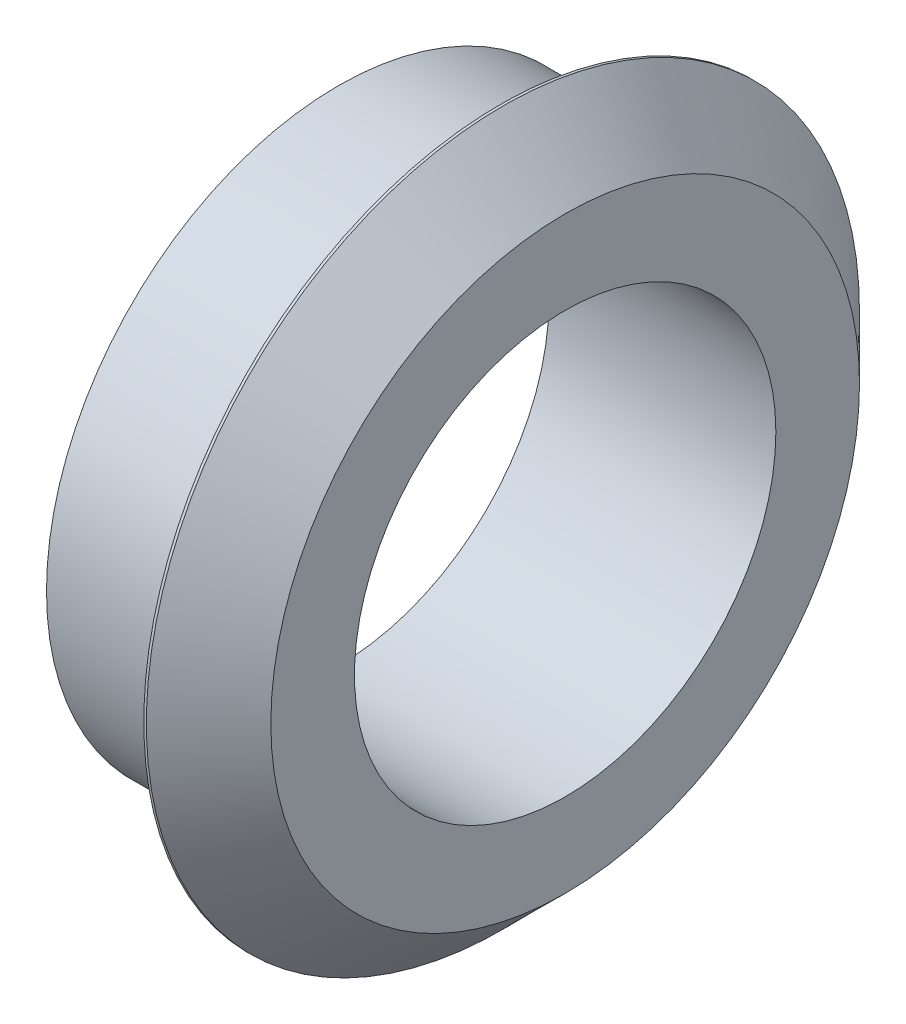
ISO-10303-21;
HEADER;
FILE_DESCRIPTION(('STEP AP214'),'2;1');
FILE_NAME('part.step','',(''),(''),'','','');
FILE_SCHEMA(('AUTOMOTIVE_DESIGN { 1 0 10303 214 1 1 1 1 }'));
ENDSEC;
DATA;
#1=APPLICATION_CONTEXT('core data for automotive mechanical design processes');
#2=APPLICATION_PROTOCOL_DEFINITION('international standard','automotive_design',2000,#1);
#3=PRODUCT_CONTEXT('',#1,'mechanical');
#4=PRODUCT('Part','Part','',(#3));
#5=PRODUCT_RELATED_PRODUCT_CATEGORY('part','',(#4));
#6=PRODUCT_DEFINITION_FORMATION('','',#4);
#7=PRODUCT_DEFINITION_CONTEXT('part definition',#1,'design');
#8=PRODUCT_DEFINITION('design','',#6,#7);
#9=PRODUCT_DEFINITION_SHAPE('','',#8);
#10=(LENGTH_UNIT() NAMED_UNIT(*) SI_UNIT(.MILLI.,.METRE.));
#11=(NAMED_UNIT(*) PLANE_ANGLE_UNIT() SI_UNIT($,.RADIAN.));
#12=(NAMED_UNIT(*) SI_UNIT($,.STERADIAN.) SOLID_ANGLE_UNIT());
#13=UNCERTAINTY_MEASURE_WITH_UNIT(LENGTH_MEASURE(1.E-05),#10,'distance_accuracy_value','');
#14=(GEOMETRIC_REPRESENTATION_CONTEXT(3) GLOBAL_UNCERTAINTY_ASSIGNED_CONTEXT((#13)) GLOBAL_UNIT_ASSIGNED_CONTEXT((#10,
#11,#12)) REPRESENTATION_CONTEXT('',''));
#15=CARTESIAN_POINT('',(0.,0.,0.));
#16=DIRECTION('',(0.,0.,1.));
#17=DIRECTION('',(1.,0.,0.));
#18=AXIS2_PLACEMENT_3D('',#15,#16,#17);
#19=CARTESIAN_POINT('',(3.60680000000002,0.,-225.73742));
#20=DIRECTION('',(1.,0.,0.));
#21=DIRECTION('',(0.,0.,-1.));
#22=AXIS2_PLACEMENT_3D('',#19,#20,#21);
#23=PLANE('',#22);
#24=CARTESIAN_POINT('',(3.60680000000002,0.,-225.73742));
#25=DIRECTION('',(1.,0.,0.));
#26=DIRECTION('',(0.,0.,-1.));
#27=AXIS2_PLACEMENT_3D('',#24,#25,#26);
#28=CIRCLE('',#27,17.4625);
#29=CARTESIAN_POINT('',(3.60680000000002,0.,-243.19992));
#30=VERTEX_POINT('',#29);
#31=EDGE_CURVE('E55',#30,#30,#28,.T.);
#32=ORIENTED_EDGE('',*,*,#31,.F.);
#33=EDGE_LOOP('',(#32));
#34=FACE_BOUND('',#33,.T.);
#35=CARTESIAN_POINT('',(3.60680000000002,0.,-225.73742));
#36=DIRECTION('',(1.,0.,0.));
#37=DIRECTION('',(0.,0.,-1.));
#38=AXIS2_PLACEMENT_3D('',#35,#36,#37);
#39=CIRCLE('',#38,14.2875);
#40=CARTESIAN_POINT('',(3.60680000000002,0.,-240.02492));
#41=VERTEX_POINT('',#40);
#42=EDGE_CURVE('E51',#41,#41,#39,.F.);
#43=ORIENTED_EDGE('',*,*,#42,.F.);
#44=EDGE_LOOP('',(#43));
#45=FACE_BOUND('',#44,.T.);
#46=ADVANCED_FACE('F39',(#34,#45),#23,.F.);
#47=CARTESIAN_POINT('',(6.78180000000001,0.,-225.73742));
#48=DIRECTION('',(1.,0.,0.));
#49=DIRECTION('',(0.,0.,-1.));
#50=AXIS2_PLACEMENT_3D('',#47,#48,#49);
#51=PLANE('',#50);
#52=CARTESIAN_POINT('',(6.78180000000001,0.,-225.73742));
#53=DIRECTION('',(1.,0.,0.));
#54=DIRECTION('',(0.,0.,-1.));
#55=AXIS2_PLACEMENT_3D('',#52,#53,#54);
#56=CIRCLE('',#55,14.4145);
#57=CARTESIAN_POINT('',(6.78180000000001,0.,-240.15192));
#58=VERTEX_POINT('',#57);
#59=EDGE_CURVE('E47',#58,#58,#56,.T.);
#60=ORIENTED_EDGE('',*,*,#59,.T.);
#61=EDGE_LOOP('',(#60));
#62=FACE_BOUND('',#61,.T.);
#63=CARTESIAN_POINT('',(6.78180000000001,0.,-225.73742));
#64=DIRECTION('',(1.,0.,0.));
#65=DIRECTION('',(0.,0.,-1.));
#66=AXIS2_PLACEMENT_3D('',#63,#64,#65);
#67=CIRCLE('',#66,10.31875);
#68=CARTESIAN_POINT('',(6.78180000000001,0.,-236.05617));
#69=VERTEX_POINT('',#68);
#70=EDGE_CURVE('E60',#69,#69,#67,.T.);
#71=ORIENTED_EDGE('',*,*,#70,.F.);
#72=EDGE_LOOP('',(#71));
#73=FACE_BOUND('',#72,.T.);
#74=ADVANCED_FACE('F86',(#62,#73),#51,.T.);
#75=CARTESIAN_POINT('',(6.78180000000001,0.,-225.73742));
#76=DIRECTION('',(-1.,0.,0.));
#77=DIRECTION('',(0.,0.,1.));
#78=AXIS2_PLACEMENT_3D('',#75,#76,#77);
#79=CYLINDRICAL_SURFACE('',#78,17.4625);
#80=CARTESIAN_POINT('',(3.73380000000001,0.,-225.73742));
#81=DIRECTION('',(1.,0.,0.));
#82=DIRECTION('',(0.,0.,-1.));
#83=AXIS2_PLACEMENT_3D('',#80,#81,#82);
#84=CIRCLE('',#83,17.4625);
#85=CARTESIAN_POINT('',(3.73380000000001,0.,-243.19992));
#86=VERTEX_POINT('',#85);
#87=EDGE_CURVE('E10',#86,#86,#84,.F.);
#88=ORIENTED_EDGE('',*,*,#87,.T.);
#89=EDGE_LOOP('',(#88));
#90=FACE_BOUND('',#89,.T.);
#91=ORIENTED_EDGE('',*,*,#31,.T.);
#92=EDGE_LOOP('',(#91));
#93=FACE_BOUND('',#92,.T.);
#94=ADVANCED_FACE('F92',(#90,#93),#79,.T.);
#95=CARTESIAN_POINT('',(6.78180000000001,0.,-225.73742));
#96=DIRECTION('',(-1.,0.,0.));
#97=DIRECTION('',(0.,0.,1.));
#98=AXIS2_PLACEMENT_3D('',#95,#96,#97);
#99=CYLINDRICAL_SURFACE('',#98,10.31875);
#100=ORIENTED_EDGE('',*,*,#70,.T.);
#101=EDGE_LOOP('',(#100));
#102=FACE_BOUND('',#101,.T.);
#103=CARTESIAN_POINT('',(-4.33069999999998,0.,-225.73742));
#104=DIRECTION('',(1.,0.,0.));
#105=DIRECTION('',(0.,0.,-1.));
#106=AXIS2_PLACEMENT_3D('',#103,#104,#105);
#107=CIRCLE('',#106,10.31875);
#108=CARTESIAN_POINT('',(-4.33069999999998,0.,-236.05617));
#109=VERTEX_POINT('',#108);
#110=EDGE_CURVE('E63',#109,#109,#107,.T.);
#111=ORIENTED_EDGE('',*,*,#110,.F.);
#112=EDGE_LOOP('',(#111));
#113=FACE_BOUND('',#112,.T.);
#114=ADVANCED_FACE('F82',(#102,#113),#99,.F.);
#115=CARTESIAN_POINT('',(-44.7418525448111,0.,-225.73742));
#116=DIRECTION('',(1.,0.,0.));
#117=DIRECTION('',(0.,0.,-1.));
#118=AXIS2_PLACEMENT_3D('',#115,#116,#117);
#119=CYLINDRICAL_SURFACE('',#118,14.2875);
#120=CARTESIAN_POINT('',(-4.33069999999998,0.,-225.73742));
#121=DIRECTION('',(1.,0.,0.));
#122=DIRECTION('',(0.,0.,-1.));
#123=AXIS2_PLACEMENT_3D('',#120,#121,#122);
#124=CIRCLE('',#123,14.2875);
#125=CARTESIAN_POINT('',(-4.33069999999998,0.,-240.02492));
#126=VERTEX_POINT('',#125);
#127=EDGE_CURVE('E66',#126,#126,#124,.T.);
#128=ORIENTED_EDGE('',*,*,#127,.T.);
#129=EDGE_LOOP('',(#128));
#130=FACE_BOUND('',#129,.T.);
#131=ORIENTED_EDGE('',*,*,#42,.T.);
#132=EDGE_LOOP('',(#131));
#133=FACE_BOUND('',#132,.T.);
#134=ADVANCED_FACE('F70',(#130,#133),#119,.T.);
#135=CARTESIAN_POINT('',(-4.33069999999998,0.,0.));
#136=DIRECTION('',(1.,0.,0.));
#137=DIRECTION('',(0.,0.,-1.));
#138=AXIS2_PLACEMENT_3D('',#135,#136,#137);
#139=PLANE('',#138);
#140=ORIENTED_EDGE('',*,*,#110,.T.);
#141=EDGE_LOOP('',(#140));
#142=FACE_BOUND('',#141,.T.);
#143=ORIENTED_EDGE('',*,*,#127,.F.);
#144=EDGE_LOOP('',(#143));
#145=FACE_BOUND('',#144,.T.);
#146=ADVANCED_FACE('F73',(#142,#145),#139,.F.);
#147=CARTESIAN_POINT('',(6.78180000000001,0.,-225.73742));
#148=DIRECTION('',(-1.,0.,0.));
#149=DIRECTION('',(0.,0.,1.));
#150=AXIS2_PLACEMENT_3D('',#147,#148,#149);
#151=CONICAL_SURFACE('',#150,14.4145,0.785398163397452);
#152=ORIENTED_EDGE('',*,*,#87,.F.);
#153=EDGE_LOOP('',(#152));
#154=FACE_BOUND('',#153,.T.);
#155=ORIENTED_EDGE('',*,*,#59,.F.);
#156=EDGE_LOOP('',(#155));
#157=FACE_BOUND('',#156,.T.);
#158=ADVANCED_FACE('F42',(#154,#157),#151,.T.);
#159=CLOSED_SHELL('',(#46,#74,#94,#114,#134,#146,#158));
#160=MANIFOLD_SOLID_BREP('B2',#159);
#161=ADVANCED_BREP_SHAPE_REPRESENTATION('',(#18,#160),#14);
#162=SHAPE_DEFINITION_REPRESENTATION(#9,#161);
ENDSEC;
END-ISO-10303-21;
